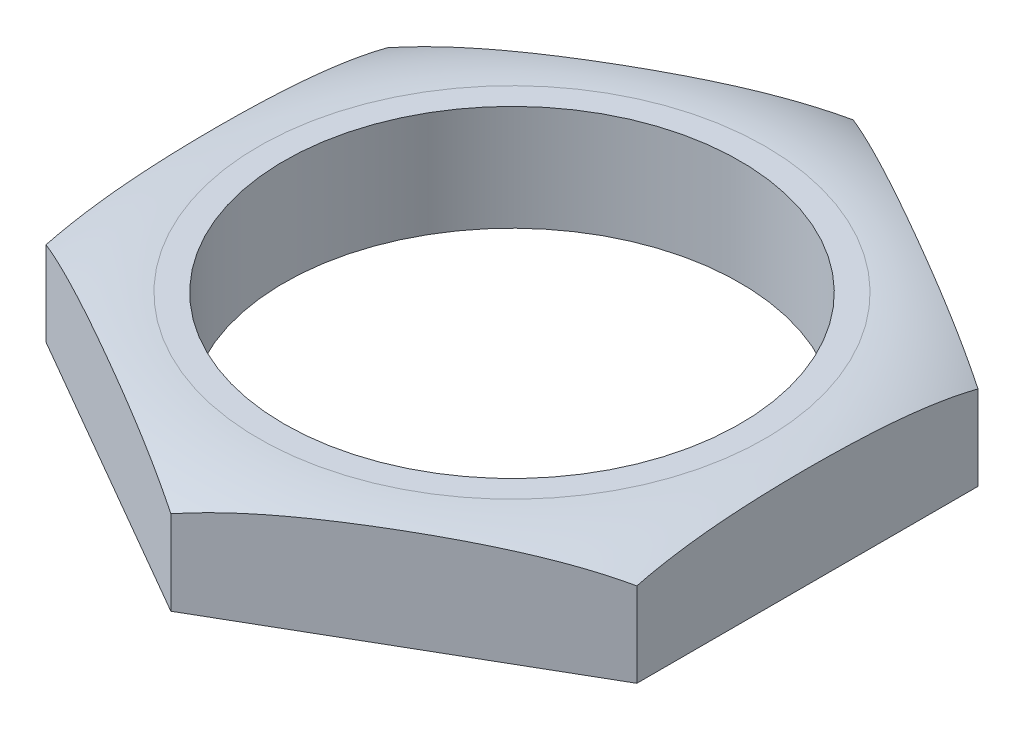
ISO-10303-21;
HEADER;
FILE_DESCRIPTION(('STEP AP214'),'2;1');
FILE_NAME('part.step','',(''),(''),'','','');
FILE_SCHEMA(('AUTOMOTIVE_DESIGN { 1 0 10303 214 1 1 1 1 }'));
ENDSEC;
DATA;
#1=APPLICATION_CONTEXT('core data for automotive mechanical design processes');
#2=APPLICATION_PROTOCOL_DEFINITION('international standard','automotive_design',2000,#1);
#3=PRODUCT_CONTEXT('',#1,'mechanical');
#4=PRODUCT('Part','Part','',(#3));
#5=PRODUCT_RELATED_PRODUCT_CATEGORY('part','',(#4));
#6=PRODUCT_DEFINITION_FORMATION('','',#4);
#7=PRODUCT_DEFINITION_CONTEXT('part definition',#1,'design');
#8=PRODUCT_DEFINITION('design','',#6,#7);
#9=PRODUCT_DEFINITION_SHAPE('','',#8);
#10=(LENGTH_UNIT() NAMED_UNIT(*) SI_UNIT(.MILLI.,.METRE.));
#11=(NAMED_UNIT(*) PLANE_ANGLE_UNIT() SI_UNIT($,.RADIAN.));
#12=(NAMED_UNIT(*) SI_UNIT($,.STERADIAN.) SOLID_ANGLE_UNIT());
#13=UNCERTAINTY_MEASURE_WITH_UNIT(LENGTH_MEASURE(1.E-05),#10,'distance_accuracy_value','');
#14=(GEOMETRIC_REPRESENTATION_CONTEXT(3) GLOBAL_UNCERTAINTY_ASSIGNED_CONTEXT((#13)) GLOBAL_UNIT_ASSIGNED_CONTEXT((#10,
#11,#12)) REPRESENTATION_CONTEXT('',''));
#15=CARTESIAN_POINT('',(0.,0.,0.));
#16=DIRECTION('',(0.,0.,1.));
#17=DIRECTION('',(1.,0.,0.));
#18=AXIS2_PLACEMENT_3D('',#15,#16,#17);
#19=CARTESIAN_POINT('',(-7.00000000000001,2.5,4.04145188432739));
#20=DIRECTION('',(0.5,0.,-0.866025403784439));
#21=DIRECTION('',(-0.866025403784439,0.,-0.5));
#22=AXIS2_PLACEMENT_3D('',#19,#20,#21);
#23=PLANE('',#22);
#24=CARTESIAN_POINT('',(-7.00020000000001,1.99994116980286,4.04133641427355));
#25=CARTESIAN_POINT('',(-6.9024311014993,2.0286993831664,4.09778331414131));
#26=CARTESIAN_POINT('',(-6.80418969926138,2.05522529599226,4.15450301416894));
#27=CARTESIAN_POINT('',(-6.60698058300385,2.10421745915421,4.26836175052687));
#28=CARTESIAN_POINT('',(-6.50801310707109,2.12668498334686,4.32550064939766));
#29=CARTESIAN_POINT('',(-6.21057702723731,2.18856517104633,4.49722545015641));
#30=CARTESIAN_POINT('',(-6.01125809296299,2.22254555707963,4.61230229051428));
#31=CARTESIAN_POINT('',(-5.61187383638535,2.27902121376591,4.84288689855947));
#32=CARTESIAN_POINT('',(-5.41181083347395,2.30153953390099,4.95839332714525));
#33=CARTESIAN_POINT('',(-5.01102203202369,2.33787021052581,5.18978884955075));
#34=CARTESIAN_POINT('',(-4.8102959726561,2.35167858888466,5.30567809396));
#35=CARTESIAN_POINT('',(-4.41139166909279,2.37247711056305,5.53598560100318));
#36=CARTESIAN_POINT('',(-4.21321681473248,2.37955940648222,5.65040190651472));
#37=CARTESIAN_POINT('',(-3.81680674878295,2.38844213687994,5.87926936480015));
#38=CARTESIAN_POINT('',(-3.61857154727333,2.39024320424813,5.9937205117546));
#39=CARTESIAN_POINT('',(-3.22195088730458,2.38889842275438,6.22270955655372));
#40=CARTESIAN_POINT('',(-3.02356543868272,2.38574852316797,6.33724744871886));
#41=CARTESIAN_POINT('',(-2.62692129753596,2.37391853623602,6.56625005038243));
#42=CARTESIAN_POINT('',(-2.42866259892704,2.3652387379873,6.68071476339347));
#43=CARTESIAN_POINT('',(-2.04346106415746,2.34159425160727,6.90311097318494));
#44=CARTESIAN_POINT('',(-1.85650172632777,2.32700568113752,7.01105199720843));
#45=CARTESIAN_POINT('',(-1.483336176554,2.28984184299611,7.22649922782261));
#46=CARTESIAN_POINT('',(-1.2971294295794,2.267273943215,7.33400574331332));
#47=CARTESIAN_POINT('',(-0.924632405346208,2.21176709168973,7.54906700052669));
#48=CARTESIAN_POINT('',(-0.738348978778219,2.17876375876016,7.65661778700128));
#49=CARTESIAN_POINT('',(-0.367459215426489,2.09976581999723,7.87075109171208));
#50=CARTESIAN_POINT('',(-0.182857484902704,2.05374271569793,7.97733095052286));
#51=CARTESIAN_POINT('',(0.000199999999992005,1.99994116980285,8.08301923870861));
#52=B_SPLINE_CURVE_WITH_KNOTS('',3,(#24,#25,#26,#27,#28,#29,#30,#31,#32,#33,#34,#35,#36,#37,#38,
#39,#40,#41,#42,#43,#44,#45,#46,#47,#48,#49,#50,#51),.UNSPECIFIED.,.F.,.F.,(4,2,2,2,2,2,2,2,2,2,
2,2,2,4),(0.,0.349439881640927,0.698769888950332,1.39630239063579,2.09242660183265,
2.78886852719074,3.47562481718198,4.16229880460008,4.84953489945155,5.53673506932823,
6.18574156363536,6.83415034176719,7.48664019182583,8.14056945107881),.UNSPECIFIED.);
#53=CARTESIAN_POINT('',(-7.00000000000001,2.00000000000001,4.04145188432739));
#54=VERTEX_POINT('',#53);
#55=CARTESIAN_POINT('',(0.,2.,8.08290376865477));
#56=VERTEX_POINT('',#55);
#57=EDGE_CURVE('E152',#54,#56,#52,.T.);
#58=ORIENTED_EDGE('',*,*,#57,.F.);
#59=DIRECTION('',(0.,-1.,0.));
#60=VECTOR('',#59,1.);
#61=CARTESIAN_POINT('',(-7.00000000000001,2.5,4.04145188432739));
#62=LINE('',#61,#60);
#63=CARTESIAN_POINT('',(-7.00000000000001,0.,4.04145188432739));
#64=VERTEX_POINT('',#63);
#65=EDGE_CURVE('E69',#54,#64,#62,.T.);
#66=ORIENTED_EDGE('',*,*,#65,.T.);
#67=DIRECTION('',(0.866025403784439,0.,0.5));
#68=VECTOR('',#67,1.);
#69=CARTESIAN_POINT('',(-7.00000000000001,0.,4.04145188432739));
#70=LINE('',#69,#68);
#71=CARTESIAN_POINT('',(0.,0.,8.08290376865477));
#72=VERTEX_POINT('',#71);
#73=EDGE_CURVE('E139',#64,#72,#70,.T.);
#74=ORIENTED_EDGE('',*,*,#73,.T.);
#75=DIRECTION('',(0.,-1.,0.));
#76=VECTOR('',#75,1.);
#77=CARTESIAN_POINT('',(0.,2.5,8.08290376865477));
#78=LINE('',#77,#76);
#79=EDGE_CURVE('E13',#56,#72,#78,.T.);
#80=ORIENTED_EDGE('',*,*,#79,.F.);
#81=EDGE_LOOP('',(#58,#66,#74,#80));
#82=FACE_BOUND('',#81,.T.);
#83=ADVANCED_FACE('F46',(#82),#23,.F.);
#84=CARTESIAN_POINT('',(0.,2.5,8.08290376865477));
#85=DIRECTION('',(-0.5,0.,-0.866025403784439));
#86=DIRECTION('',(-0.866025403784439,0.,0.5));
#87=AXIS2_PLACEMENT_3D('',#84,#85,#86);
#88=PLANE('',#87);
#89=CARTESIAN_POINT('',(-0.000199999999999705,1.99994116980285,8.08301923870861));
#90=CARTESIAN_POINT('',(0.0975688985007056,2.02869938316639,8.02657233884085));
#91=CARTESIAN_POINT('',(0.195810300738627,2.05522529599226,7.96985263881322));
#92=CARTESIAN_POINT('',(0.39301941699616,2.1042174591542,7.85599390245529));
#93=CARTESIAN_POINT('',(0.491986892928916,2.12668498334686,7.79885500358449));
#94=CARTESIAN_POINT('',(0.7894229727627,2.18856517104633,7.62713020282575));
#95=CARTESIAN_POINT('',(0.988741907037024,2.22254555707963,7.51205336246788));
#96=CARTESIAN_POINT('',(1.38812616361466,2.27902121376591,7.28146875442268));
#97=CARTESIAN_POINT('',(1.58818916652606,2.30153953390099,7.1659623258369));
#98=CARTESIAN_POINT('',(1.98897796797633,2.33787021052581,6.9345668034314));
#99=CARTESIAN_POINT('',(2.18970402734391,2.35167858888466,6.81867755902215));
#100=CARTESIAN_POINT('',(2.58860833090723,2.37247711056305,6.58837005197897));
#101=CARTESIAN_POINT('',(2.78678318526754,2.37955940648222,6.47395374646743));
#102=CARTESIAN_POINT('',(3.18319325121707,2.38844213687994,6.245086288182));
#103=CARTESIAN_POINT('',(3.38142845272669,2.39024320424813,6.13063514122755));
#104=CARTESIAN_POINT('',(3.77804911269544,2.38889842275438,5.90164609642843));
#105=CARTESIAN_POINT('',(3.9764345613173,2.38574852316797,5.78710820426329));
#106=CARTESIAN_POINT('',(4.37307870246407,2.37391853623602,5.55810560259972));
#107=CARTESIAN_POINT('',(4.57133740107298,2.3652387379873,5.44364088958868));
#108=CARTESIAN_POINT('',(4.95653893584256,2.34159425160727,5.2212446797972));
#109=CARTESIAN_POINT('',(5.14349827367225,2.32700568113752,5.11330365577372));
#110=CARTESIAN_POINT('',(5.51666382344602,2.28984184299611,4.89785642515954));
#111=CARTESIAN_POINT('',(5.70287057042062,2.267273943215,4.79034990966883));
#112=CARTESIAN_POINT('',(6.0753675946538,2.21176709168973,4.57528865245546));
#113=CARTESIAN_POINT('',(6.26165102122179,2.17876375876017,4.46773786598087));
#114=CARTESIAN_POINT('',(6.63254078457352,2.09976581999724,4.25360456127008));
#115=CARTESIAN_POINT('',(6.8171425150973,2.05374271569794,4.1470247024593));
#116=CARTESIAN_POINT('',(7.00019999999999,1.99994116980286,4.04133641427355));
#117=B_SPLINE_CURVE_WITH_KNOTS('',3,(#89,#90,#91,#92,#93,#94,#95,#96,#97,#98,#99,#100,#101,#102,
#103,#104,#105,#106,#107,#108,#109,#110,#111,#112,#113,#114,#115,#116),.UNSPECIFIED.,.F.,.F.,(4,
2,2,2,2,2,2,2,2,2,2,2,2,4),(0.,0.349439881640928,0.698769888950335,1.3963023906358,
2.09242660183266,2.78886852719076,3.475624817182,4.16229880460009,4.84953489945157,
5.53673506932825,6.18574156363537,6.8341503417672,7.48664019182583,8.1405694510788),.UNSPECIFIED.);
#118=CARTESIAN_POINT('',(7.,2.00000000000001,4.0414518843274));
#119=VERTEX_POINT('',#118);
#120=EDGE_CURVE('E153',#56,#119,#117,.T.);
#121=ORIENTED_EDGE('',*,*,#120,.F.);
#122=ORIENTED_EDGE('',*,*,#79,.T.);
#123=DIRECTION('',(0.866025403784439,0.,-0.5));
#124=VECTOR('',#123,1.);
#125=CARTESIAN_POINT('',(0.,0.,8.08290376865477));
#126=LINE('',#125,#124);
#127=CARTESIAN_POINT('',(7.,0.,4.04145188432739));
#128=VERTEX_POINT('',#127);
#129=EDGE_CURVE('E134',#72,#128,#126,.T.);
#130=ORIENTED_EDGE('',*,*,#129,.T.);
#131=DIRECTION('',(0.,-1.,0.));
#132=VECTOR('',#131,1.);
#133=CARTESIAN_POINT('',(7.,2.5,4.04145188432739));
#134=LINE('',#133,#132);
#135=EDGE_CURVE('E54',#119,#128,#134,.T.);
#136=ORIENTED_EDGE('',*,*,#135,.F.);
#137=EDGE_LOOP('',(#121,#122,#130,#136));
#138=FACE_BOUND('',#137,.T.);
#139=ADVANCED_FACE('F135',(#138),#88,.F.);
#140=CARTESIAN_POINT('',(7.,2.5,4.04145188432739));
#141=DIRECTION('',(-1.,0.,0.));
#142=DIRECTION('',(0.,0.,1.));
#143=AXIS2_PLACEMENT_3D('',#140,#141,#142);
#144=PLANE('',#143);
#145=CARTESIAN_POINT('',(6.99999999999999,2.38970607242398,0.));
#146=CARTESIAN_POINT('',(6.99999999999999,2.38970380710305,-0.153474797880013));
#147=CARTESIAN_POINT('',(6.99999999999999,2.38858612905045,-0.306948641245881));
#148=CARTESIAN_POINT('',(6.99999999999999,2.38401758755966,-0.613861027468486));
#149=CARTESIAN_POINT('',(6.99999999999999,2.38056674765726,-0.767299570665696));
#150=CARTESIAN_POINT('',(6.99999999999999,2.37106321640344,-1.0741518824378));
#151=CARTESIAN_POINT('',(6.99999999999999,2.36500964359593,-1.22756562498945));
#152=CARTESIAN_POINT('',(6.99999999999999,2.34985531271487,-1.53424094228322));
#153=CARTESIAN_POINT('',(6.99999999999999,2.34075451578797,-1.68750251506012));
#154=CARTESIAN_POINT('',(6.99999999999999,2.3080649192442,-2.14650821008781));
#155=CARTESIAN_POINT('',(6.99999999999999,2.27907832767328,-2.45191427477796));
#156=CARTESIAN_POINT('',(6.99999999999999,2.20067768750192,-3.05997729615631));
#157=CARTESIAN_POINT('',(6.99999999999999,2.15128001099699,-3.36263625794929));
#158=CARTESIAN_POINT('',(6.99999999999999,2.0186258035697,-3.99151659203636));
#159=CARTESIAN_POINT('',(6.99999999999999,1.9325495611885,-4.31717553159758));
#160=CARTESIAN_POINT('',(6.99999999999999,1.71722654974047,-4.95405760901862));
#161=CARTESIAN_POINT('',(6.99999999999999,1.58803539877385,-5.26529875972476));
#162=CARTESIAN_POINT('',(6.99999999999999,1.30834340724966,-5.80338189986762));
#163=CARTESIAN_POINT('',(6.99999999999999,1.16692743561404,-6.03483800474802));
#164=CARTESIAN_POINT('',(6.99999999999999,0.928233227054043,-6.36246423416456));
#165=CARTESIAN_POINT('',(6.99999999999999,0.844239207510924,-6.46841422047163));
#166=CARTESIAN_POINT('',(6.99999999999999,0.667320613679811,-6.67261053253427));
#167=CARTESIAN_POINT('',(6.99999999999999,0.574397823104398,-6.77085838986265));
#168=CARTESIAN_POINT('',(6.99999999999999,0.397912843244333,-6.94085531994078));
#169=CARTESIAN_POINT('',(6.99999999999999,0.315821463585398,-7.01413532931855));
#170=CARTESIAN_POINT('',(6.99999999999999,0.146079095604071,-7.153936074823));
#171=CARTESIAN_POINT('',(6.99999999999999,0.05842922210721,-7.220458159416));
#172=CARTESIAN_POINT('',(6.99999999999999,-0.122104708156981,-7.34601007506838));
#173=CARTESIAN_POINT('',(6.99999999999999,-0.214989263628966,-7.40503919052935));
#174=CARTESIAN_POINT('',(6.99999999999999,-0.405465187560716,-7.51484698382192));
#175=CARTESIAN_POINT('',(6.99999999999999,-0.503054275778988,-7.56562960752976));
#176=CARTESIAN_POINT('',(6.99999999999999,-0.702990876341273,-7.65859107812109));
#177=CARTESIAN_POINT('',(6.99999999999999,-0.805364025999912,-7.70071492477886));
#178=CARTESIAN_POINT('',(6.99999999999999,-1.01351545988163,-7.7753428365705));
#179=CARTESIAN_POINT('',(6.99999999999999,-1.11929221909229,-7.80785114526187));
#180=CARTESIAN_POINT('',(6.99999999999999,-1.33343125496827,-7.86278149447861));
#181=CARTESIAN_POINT('',(6.99999999999999,-1.44179337597888,-7.88520414061742));
#182=CARTESIAN_POINT('',(6.99999999999999,-1.66015904232018,-7.91961284032709));
#183=CARTESIAN_POINT('',(6.99999999999999,-1.77016242999534,-7.93159988983085));
#184=CARTESIAN_POINT('',(6.99999999999999,-1.97994119378055,-7.94429281633209));
#185=CARTESIAN_POINT('',(6.99999999999999,-2.0796576001692,-7.94599292316537));
#186=CARTESIAN_POINT('',(6.99999999999999,-2.2788971141417,-7.94073844585596));
#187=CARTESIAN_POINT('',(6.99999999999999,-2.37842014472676,-7.93378092721313));
#188=CARTESIAN_POINT('',(6.99999999999999,-2.57643634714082,-7.91129905778737));
#189=CARTESIAN_POINT('',(6.99999999999999,-2.67493010449194,-7.89577988197687));
#190=CARTESIAN_POINT('',(6.99999999999999,-2.87024413709382,-7.85638757995707));
#191=CARTESIAN_POINT('',(6.99999999999999,-2.96706377206045,-7.83251132855726));
#192=CARTESIAN_POINT('',(6.99999999999999,-3.24961476198406,-7.75002117367003));
#193=CARTESIAN_POINT('',(6.99999999999999,-3.43213651713589,-7.67998804117463));
#194=CARTESIAN_POINT('',(6.99999999999999,-3.78375625882706,-7.51220944744738));
#195=CARTESIAN_POINT('',(6.99999999999999,-3.95285319473115,-7.41446181999193));
#196=CARTESIAN_POINT('',(6.99999999999999,-4.28581822794355,-7.18760703783438));
#197=CARTESIAN_POINT('',(6.99999999999999,-4.44852815183203,-7.05680627610971));
#198=CARTESIAN_POINT('',(6.99999999999999,-4.75333265351634,-6.77301770900496));
#199=CARTESIAN_POINT('',(6.99999999999999,-4.89541094290621,-6.62001256203388));
#200=CARTESIAN_POINT('',(6.99999999999999,-5.12351287077039,-6.33957063845203));
#201=CARTESIAN_POINT('',(6.99999999999999,-5.2144322703192,-6.21604876030427));
#202=CARTESIAN_POINT('',(6.99999999999999,-5.38499478121861,-5.96142369386902));
#203=CARTESIAN_POINT('',(6.99999999999999,-5.46463352341515,-5.83031759564708));
#204=CARTESIAN_POINT('',(6.99999999999999,-5.68724788208596,-5.42796406276954));
#205=CARTESIAN_POINT('',(6.99999999999999,-5.81396431770249,-5.14762708255227));
#206=CARTESIAN_POINT('',(6.99999999999999,-6.01041854508655,-4.62420313737151));
#207=CARTESIAN_POINT('',(6.99999999999999,-6.08626885905089,-4.38329133387102));
#208=CARTESIAN_POINT('',(6.99999999999999,-6.21654925850452,-3.89560716687764));
#209=CARTESIAN_POINT('',(6.99999999999999,-6.27096223892484,-3.64883028937009));
#210=CARTESIAN_POINT('',(6.99999999999999,-6.36269037059578,-3.1508441112275));
#211=CARTESIAN_POINT('',(6.99999999999999,-6.39991016719901,-2.89961792933025));
#212=CARTESIAN_POINT('',(6.99999999999999,-6.46084811563187,-2.39566329281924));
#213=CARTESIAN_POINT('',(6.99999999999999,-6.48456981256615,-2.14293525028586));
#214=CARTESIAN_POINT('',(6.99999999999999,-6.51858850823015,-1.68215858925161));
#215=CARTESIAN_POINT('',(6.99999999999999,-6.5305299208123,-1.4742236086835));
#216=CARTESIAN_POINT('',(6.99999999999999,-6.54906143468367,-1.05810455238561));
#217=CARTESIAN_POINT('',(6.99999999999999,-6.55565109172148,-0.849920457412993));
#218=CARTESIAN_POINT('',(6.99999999999999,-6.56440651058935,-0.433298560899161));
#219=CARTESIAN_POINT('',(6.99999999999999,-6.56656873831265,-0.224860689466228));
#220=CARTESIAN_POINT('',(6.99999999999999,-6.56678723713752,0.192008531875751));
#221=CARTESIAN_POINT('',(6.99999999999999,-6.56484368342921,0.400439881683582));
#222=CARTESIAN_POINT('',(6.99999999999999,-6.55657163845878,0.816358710062174));
#223=CARTESIAN_POINT('',(6.99999999999999,-6.55026128189937,1.02384653308402));
#224=CARTESIAN_POINT('',(6.99999999999999,-6.53239018971206,1.43862365537169));
#225=CARTESIAN_POINT('',(6.99999999999999,-6.52082901392069,1.64591293653412));
#226=CARTESIAN_POINT('',(6.99999999999999,-6.49107253506154,2.05978432243926));
#227=CARTESIAN_POINT('',(6.99999999999999,-6.47288508693345,2.26636697336596));
#228=CARTESIAN_POINT('',(6.99999999999999,-6.42806910735174,2.67859610998877));
#229=CARTESIAN_POINT('',(7.,-6.40144271589586,2.88424281963031));
#230=CARTESIAN_POINT('',(7.,-6.3445190691219,3.24975962090773));
#231=CARTESIAN_POINT('',(7.,-6.31625001048584,3.40994262168731));
#232=CARTESIAN_POINT('',(7.,-6.25212076879051,3.72881934231341));
#233=CARTESIAN_POINT('',(7.,-6.21625984084868,3.88751291442666));
#234=CARTESIAN_POINT('',(7.,-6.13582370636988,4.20272110922243));
#235=CARTESIAN_POINT('',(7.,-6.0912474208148,4.35923545953024));
#236=CARTESIAN_POINT('',(7.,-5.99227926457707,4.66915357255124));
#237=CARTESIAN_POINT('',(7.,-5.93788770555855,4.82255743385972));
#238=CARTESIAN_POINT('',(7.,-5.81744361415367,5.12714453125906));
#239=CARTESIAN_POINT('',(7.,-5.75124405976618,5.27827013542966));
#240=CARTESIAN_POINT('',(7.,-5.60676552948873,5.57462580985689));
#241=CARTESIAN_POINT('',(7.,-5.52849004964834,5.71985757109346));
#242=CARTESIAN_POINT('',(7.,-5.35922285290208,6.00251022801988));
#243=CARTESIAN_POINT('',(7.,-5.26824715260247,6.13994065979281));
#244=CARTESIAN_POINT('',(7.,-5.07310020717452,6.40508109391197));
#245=CARTESIAN_POINT('',(7.,-4.96893559699309,6.53279593252323));
#246=CARTESIAN_POINT('',(7.,-4.78253027773868,6.73763399143548));
#247=CARTESIAN_POINT('',(7.,-4.70379806632288,6.81796702956086));
#248=CARTESIAN_POINT('',(7.,-4.540318291138,6.97224596864263));
#249=CARTESIAN_POINT('',(7.,-4.45557230662786,7.04619353524344));
#250=CARTESIAN_POINT('',(7.,-4.28031009926545,7.18691142957461));
#251=CARTESIAN_POINT('',(7.,-4.18979405130168,7.25368197467322));
#252=CARTESIAN_POINT('',(7.,-4.00342258484872,7.37922307594957));
#253=CARTESIAN_POINT('',(7.,-3.90756968410959,7.43799736017995));
#254=CARTESIAN_POINT('',(7.,-3.71032408786865,7.54720086865784));
#255=CARTESIAN_POINT('',(7.,-3.60889705056362,7.59756822861717));
#256=CARTESIAN_POINT('',(7.,-3.40186630654638,7.68871026796446));
#257=CARTESIAN_POINT('',(7.,-3.29626454183861,7.72948934770584));
#258=CARTESIAN_POINT('',(7.,-3.08167410328328,7.80086342201253));
#259=CARTESIAN_POINT('',(7.,-2.97268564482536,7.83145906278877));
#260=CARTESIAN_POINT('',(7.,-2.75226517810287,7.88197889287165));
#261=CARTESIAN_POINT('',(7.,-2.64083343686204,7.90190424233139));
#262=CARTESIAN_POINT('',(7.,-2.42828713428676,7.92925131876027));
#263=CARTESIAN_POINT('',(7.,-2.32731143330575,7.93776217651678));
#264=CARTESIAN_POINT('',(7.,-2.12496579268856,7.94585842612113));
#265=CARTESIAN_POINT('',(7.,-2.02359573018757,7.94544076870151));
#266=CARTESIAN_POINT('',(7.,-1.82135186970049,7.93567618224392));
#267=CARTESIAN_POINT('',(7.,-1.72047777862864,7.92633538770141));
#268=CARTESIAN_POINT('',(7.,-1.51992128828028,7.89887009464376));
#269=CARTESIAN_POINT('',(7.,-1.42023934448726,7.88074234225376));
#270=CARTESIAN_POINT('',(7.,-1.13225032443934,7.81533140302399));
#271=CARTESIAN_POINT('',(7.,-0.946431189926209,7.75655332582932));
#272=CARTESIAN_POINT('',(7.,-0.586702067967606,7.61017419221811));
#273=CARTESIAN_POINT('',(7.,-0.412793081505804,7.52257071676514));
#274=CARTESIAN_POINT('',(7.,-0.0713998261189954,7.31688328456176));
#275=CARTESIAN_POINT('',(7.,0.0952567509406784,7.19743107380679));
#276=CARTESIAN_POINT('',(7.,0.40920323530402,6.93534919153726));
#277=CARTESIAN_POINT('',(7.,0.556483471018514,6.79270802420508));
#278=CARTESIAN_POINT('',(7.,0.790990143441878,6.53294931832184));
#279=CARTESIAN_POINT('',(7.,0.883287798460253,6.42033107068375));
#280=CARTESIAN_POINT('',(7.,1.05759312254795,6.18737229192974));
#281=CARTESIAN_POINT('',(7.,1.13959726772831,6.06702913745626));
#282=CARTESIAN_POINT('',(7.,1.37063740287318,5.69633426627025));
#283=CARTESIAN_POINT('',(7.,1.50457660135089,5.43645926557818));
#284=CARTESIAN_POINT('',(7.,1.71047300790161,4.960730273259));
#285=CARTESIAN_POINT('',(7.,1.78958605638935,4.74782869719772));
#286=CARTESIAN_POINT('',(7.,1.9287042211905,4.31575039233941));
#287=CARTESIAN_POINT('',(7.,1.98869650340562,4.09656955592443));
#288=CARTESIAN_POINT('',(7.,2.09258189243331,3.65407418034792));
#289=CARTESIAN_POINT('',(7.,2.1364430608383,3.43075235037118));
#290=CARTESIAN_POINT('',(7.,2.21095405128979,2.98201160960899));
#291=CARTESIAN_POINT('',(6.99999999999999,2.24160617250766,2.75659307076118));
#292=CARTESIAN_POINT('',(6.99999999999999,2.29072189196327,2.32065837446527));
#293=CARTESIAN_POINT('',(6.99999999999999,2.30989573163815,2.11021911723506));
#294=CARTESIAN_POINT('',(6.99999999999999,2.34122733977781,1.6888374593472));
#295=CARTESIAN_POINT('',(6.99999999999999,2.35338515004378,1.47789506169477));
#296=CARTESIAN_POINT('',(6.99999999999999,2.37219095307572,1.05584328395048));
#297=CARTESIAN_POINT('',(6.99999999999999,2.37884068422983,0.844733977607092));
#298=CARTESIAN_POINT('',(6.99999999999999,2.38759989763807,0.422415847474331));
#299=CARTESIAN_POINT('',(6.99999999999999,2.38970918988489,0.211207019890145));
#300=CARTESIAN_POINT('',(6.99999999999999,2.38970607242398,0.));
#301=B_SPLINE_CURVE_WITH_KNOTS('',3,(#145,#146,#147,#148,#149,#150,#151,#152,#153,#154,#155,
#156,#157,#158,#159,#160,#161,#162,#163,#164,#165,#166,#167,#168,#169,#170,#171,#172,#173,#174,
#175,#176,#177,#178,#179,#180,#181,#182,#183,#184,#185,#186,#187,#188,#189,#190,#191,#192,#193,
#194,#195,#196,#197,#198,#199,#200,#201,#202,#203,#204,#205,#206,#207,#208,#209,#210,#211,#212,
#213,#214,#215,#216,#217,#218,#219,#220,#221,#222,#223,#224,#225,#226,#227,#228,#229,#230,#231,
#232,#233,#234,#235,#236,#237,#238,#239,#240,#241,#242,#243,#244,#245,#246,#247,#248,#249,#250,
#251,#252,#253,#254,#255,#256,#257,#258,#259,#260,#261,#262,#263,#264,#265,#266,#267,#268,#269,
#270,#271,#272,#273,#274,#275,#276,#277,#278,#279,#280,#281,#282,#283,#284,#285,#286,#287,#288,
#289,#290,#291,#292,#293,#294,#295,#296,#297,#298,#299,#300),.UNSPECIFIED.,.T.,.F.,(4,2,2,2,2,2,
2,2,2,2,2,2,2,2,2,2,2,2,2,2,2,2,2,2,2,2,2,2,2,2,2,2,2,2,2,2,2,2,2,2,2,2,2,2,2,2,2,2,2,2,2,2,2,2,
2,2,2,2,2,2,2,2,2,2,2,2,2,2,2,2,2,2,2,2,2,2,2,4),(0.,0.460418193545401,0.920831742687712,
1.38140134102967,1.8419768120439,2.76180550663538,3.68089781808519,4.68914910012407,
5.6961047364611,6.50646555562077,6.9116535306853,7.3167607284291,7.64656421856631,
7.97630177040681,8.30607078940291,8.63568154879129,8.96732535251315,9.29882257508887,
9.63029988960375,9.96174556573918,10.2605685250411,10.5594927979104,10.8582365878805,
11.1570922148803,11.7407885194304,12.3245304595027,12.9483932507842,13.5727459266056,
14.0322570418937,14.4919456483542,15.4111182554443,16.1678090237024,16.9251023463938,
17.6865466850622,18.44779094762,19.0725468688563,19.6973546460388,20.322660969395,
20.9479406120147,21.5706390204822,22.1933896378873,22.8154044212551,23.4372615964284,
23.9250843604531,24.4129550098146,24.9008860990354,25.3888016977177,25.8832807888448,
26.3776169931552,26.8713353153236,27.3648062421044,27.7019478642097,28.0390012758854,
28.3760444764492,28.7129299967525,29.0521946133448,29.3913032258536,29.7303903154274,
30.0694405294527,30.3730562541394,30.6767756713573,30.9802864371198,31.2839096811045,
31.8657481442528,32.4476354479255,33.0603316701021,33.6733325650593,34.1095851718075,
34.5459867206775,35.4193494311912,36.0998407941974,36.7807879543085,37.4630761721432,
38.145245582636,38.779035476024,39.4128215932812,40.0464076069281,40.6800201342301),.UNSPECIFIED.);
#302=CARTESIAN_POINT('',(7.00000000000001,2.00000000000002,-4.04145188432737));
#303=VERTEX_POINT('',#302);
#304=EDGE_CURVE('E101',#119,#303,#301,.T.);
#305=ORIENTED_EDGE('',*,*,#304,.F.);
#306=ORIENTED_EDGE('',*,*,#135,.T.);
#307=DIRECTION('',(0.,0.,-1.));
#308=VECTOR('',#307,1.);
#309=CARTESIAN_POINT('',(7.,0.,4.04145188432739));
#310=LINE('',#309,#308);
#311=CARTESIAN_POINT('',(6.99999999999999,0.,-4.04145188432738));
#312=VERTEX_POINT('',#311);
#313=EDGE_CURVE('E130',#128,#312,#310,.T.);
#314=ORIENTED_EDGE('',*,*,#313,.T.);
#315=DIRECTION('',(0.,-1.,0.));
#316=VECTOR('',#315,1.);
#317=CARTESIAN_POINT('',(6.99999999999999,2.5,-4.04145188432738));
#318=LINE('',#317,#316);
#319=EDGE_CURVE('E119',#303,#312,#318,.T.);
#320=ORIENTED_EDGE('',*,*,#319,.F.);
#321=EDGE_LOOP('',(#305,#306,#314,#320));
#322=FACE_BOUND('',#321,.T.);
#323=ADVANCED_FACE('F128',(#322),#144,.F.);
#324=CARTESIAN_POINT('',(6.99999999999999,2.5,-4.04145188432738));
#325=DIRECTION('',(-0.5,0.,0.866025403784439));
#326=DIRECTION('',(0.866025403784439,0.,0.5));
#327=AXIS2_PLACEMENT_3D('',#324,#325,#326);
#328=PLANE('',#327);
#329=CARTESIAN_POINT('',(7.00019999999999,1.99994116980288,-4.04133641427354));
#330=CARTESIAN_POINT('',(6.90243110149929,2.02869938316642,-4.0977833141413));
#331=CARTESIAN_POINT('',(6.80418969926136,2.05522529599228,-4.15450301416893));
#332=CARTESIAN_POINT('',(6.60698058300383,2.10421745915423,-4.26836175052686));
#333=CARTESIAN_POINT('',(6.50801310707107,2.12668498334688,-4.32550064939766));
#334=CARTESIAN_POINT('',(6.21057702723729,2.18856517104635,-4.4972254501564));
#335=CARTESIAN_POINT('',(6.01125809296296,2.22254555707965,-4.61230229051427));
#336=CARTESIAN_POINT('',(5.61187383638532,2.27902121376593,-4.84288689855947));
#337=CARTESIAN_POINT('',(5.41181083347391,2.30153953390101,-4.95839332714526));
#338=CARTESIAN_POINT('',(5.01102203202365,2.33787021052584,-5.18978884955076));
#339=CARTESIAN_POINT('',(4.81029597265606,2.35167858888469,-5.30567809396001));
#340=CARTESIAN_POINT('',(4.41139166909274,2.37247711056308,-5.53598560100319));
#341=CARTESIAN_POINT('',(4.21321681473243,2.37955940648224,-5.65040190651473));
#342=CARTESIAN_POINT('',(3.8168067487829,2.38844213687996,-5.87926936480017));
#343=CARTESIAN_POINT('',(3.61857154727327,2.39024320424815,-5.99372051175461));
#344=CARTESIAN_POINT('',(3.22195088730451,2.3888984227544,-6.22270955655374));
#345=CARTESIAN_POINT('',(3.02356543868265,2.38574852316799,-6.33724744871888));
#346=CARTESIAN_POINT('',(2.62692129753588,2.37391853623604,-6.56625005038245));
#347=CARTESIAN_POINT('',(2.42866259892697,2.36523873798732,-6.6807147633935));
#348=CARTESIAN_POINT('',(2.04346106415739,2.34159425160729,-6.90311097318497));
#349=CARTESIAN_POINT('',(1.85650172632771,2.32700568113754,-7.01105199720845));
#350=CARTESIAN_POINT('',(1.48333617655395,2.28984184299613,-7.22649922782262));
#351=CARTESIAN_POINT('',(1.29712942957935,2.26727394321502,-7.33400574331333));
#352=CARTESIAN_POINT('',(0.924632405346171,2.21176709168975,-7.54906700052669));
#353=CARTESIAN_POINT('',(0.738348978778189,2.17876375876019,-7.65661778700128));
#354=CARTESIAN_POINT('',(0.36745921542647,2.09976581999726,-7.87075109171207));
#355=CARTESIAN_POINT('',(0.18285748490269,2.05374271569796,-7.97733095052285));
#356=CARTESIAN_POINT('',(-0.000200000000000166,1.99994116980288,-8.08301923870859));
#357=B_SPLINE_CURVE_WITH_KNOTS('',3,(#329,#330,#331,#332,#333,#334,#335,#336,#337,#338,#339,
#340,#341,#342,#343,#344,#345,#346,#347,#348,#349,#350,#351,#352,#353,#354,#355,#356),
.UNSPECIFIED.,.F.,.F.,(4,2,2,2,2,2,2,2,2,2,2,2,2,4),(0.,0.34943988164093,0.69876988895034,
1.39630239063581,2.09242660183268,2.78886852719078,3.47562481718203,4.16229880460013,
4.84953489945162,5.5367350693283,6.18574156363541,6.83415034176722,7.48664019182584,
8.1405694510788),.UNSPECIFIED.);
#358=CARTESIAN_POINT('',(0.,2.00000000000003,-8.08290376865476));
#359=VERTEX_POINT('',#358);
#360=EDGE_CURVE('E98',#303,#359,#357,.T.);
#361=ORIENTED_EDGE('',*,*,#360,.F.);
#362=ORIENTED_EDGE('',*,*,#319,.T.);
#363=DIRECTION('',(-0.866025403784439,0.,-0.5));
#364=VECTOR('',#363,1.);
#365=CARTESIAN_POINT('',(6.99999999999999,0.,-4.04145188432738));
#366=LINE('',#365,#364);
#367=CARTESIAN_POINT('',(0.,0.,-8.08290376865476));
#368=VERTEX_POINT('',#367);
#369=EDGE_CURVE('E117',#312,#368,#366,.T.);
#370=ORIENTED_EDGE('',*,*,#369,.T.);
#371=DIRECTION('',(0.,-1.,0.));
#372=VECTOR('',#371,1.);
#373=CARTESIAN_POINT('',(0.,2.5,-8.08290376865476));
#374=LINE('',#373,#372);
#375=EDGE_CURVE('E110',#359,#368,#374,.T.);
#376=ORIENTED_EDGE('',*,*,#375,.F.);
#377=EDGE_LOOP('',(#361,#362,#370,#376));
#378=FACE_BOUND('',#377,.T.);
#379=ADVANCED_FACE('F115',(#378),#328,.F.);
#380=CARTESIAN_POINT('',(0.,2.5,-8.08290376865476));
#381=DIRECTION('',(0.5,0.,0.866025403784438));
#382=DIRECTION('',(0.866025403784438,0.,-0.5));
#383=AXIS2_PLACEMENT_3D('',#380,#381,#382);
#384=PLANE('',#383);
#385=CARTESIAN_POINT('',(0.000199999999992063,1.99994116980288,-8.08301923870859));
#386=CARTESIAN_POINT('',(-0.0975688985007135,2.02869938316642,-8.02657233884084));
#387=CARTESIAN_POINT('',(-0.195810300738636,2.05522529599229,-7.96985263881321));
#388=CARTESIAN_POINT('',(-0.39301941699617,2.10421745915423,-7.85599390245527));
#389=CARTESIAN_POINT('',(-0.491986892928926,2.12668498334689,-7.79885500358448));
#390=CARTESIAN_POINT('',(-0.789422972762712,2.18856517104636,-7.62713020282573));
#391=CARTESIAN_POINT('',(-0.988741907037038,2.22254555707966,-7.51205336246786));
#392=CARTESIAN_POINT('',(-1.38812616361468,2.27902121376594,-7.28146875442266));
#393=CARTESIAN_POINT('',(-1.58818916652608,2.30153953390101,-7.16596232583688));
#394=CARTESIAN_POINT('',(-1.98897796797635,2.33787021052584,-6.93456680343138));
#395=CARTESIAN_POINT('',(-2.18970402734393,2.35167858888469,-6.81867755902213));
#396=CARTESIAN_POINT('',(-2.58860833090725,2.37247711056308,-6.58837005197895));
#397=CARTESIAN_POINT('',(-2.78678318526757,2.37955940648224,-6.47395374646741));
#398=CARTESIAN_POINT('',(-3.1831932512171,2.38844213687996,-6.24508628818197));
#399=CARTESIAN_POINT('',(-3.38142845272672,2.39024320424815,-6.13063514122752));
#400=CARTESIAN_POINT('',(-3.77804911269548,2.3888984227544,-5.9016460964284));
#401=CARTESIAN_POINT('',(-3.97643456131734,2.38574852316799,-5.78710820426326));
#402=CARTESIAN_POINT('',(-4.37307870246411,2.37391853623604,-5.55810560259969));
#403=CARTESIAN_POINT('',(-4.57133740107302,2.36523873798732,-5.44364088958864));
#404=CARTESIAN_POINT('',(-4.9565389358426,2.34159425160729,-5.22124467979717));
#405=CARTESIAN_POINT('',(-5.14349827367228,2.32700568113753,-5.11330365577369));
#406=CARTESIAN_POINT('',(-5.51666382344605,2.28984184299613,-4.89785642515951));
#407=CARTESIAN_POINT('',(-5.70287057042064,2.26727394321502,-4.7903499096688));
#408=CARTESIAN_POINT('',(-6.07536759465383,2.21176709168974,-4.57528865245544));
#409=CARTESIAN_POINT('',(-6.26165102122181,2.17876375876018,-4.46773786598085));
#410=CARTESIAN_POINT('',(-6.63254078457353,2.09976581999725,-4.25360456127005));
#411=CARTESIAN_POINT('',(-6.81714251509731,2.05374271569796,-4.14702470245928));
#412=CARTESIAN_POINT('',(-7.0002,1.99994116980287,-4.04133641427353));
#413=B_SPLINE_CURVE_WITH_KNOTS('',3,(#385,#386,#387,#388,#389,#390,#391,#392,#393,#394,#395,
#396,#397,#398,#399,#400,#401,#402,#403,#404,#405,#406,#407,#408,#409,#410,#411,#412),
.UNSPECIFIED.,.F.,.F.,(4,2,2,2,2,2,2,2,2,2,2,2,2,4),(0.,0.34943988164093,0.69876988895034,
1.39630239063581,2.09242660183268,2.78886852719077,3.47562481718202,4.16229880460012,
4.8495348994516,5.53673506932829,6.1857415636354,6.83415034176722,7.48664019182584,
8.1405694510788),.UNSPECIFIED.);
#414=CARTESIAN_POINT('',(-7.00000000000001,2.00000000000002,-4.04145188432737));
#415=VERTEX_POINT('',#414);
#416=EDGE_CURVE('E61',#359,#415,#413,.T.);
#417=ORIENTED_EDGE('',*,*,#416,.F.);
#418=ORIENTED_EDGE('',*,*,#375,.T.);
#419=DIRECTION('',(-0.866025403784438,0.,0.5));
#420=VECTOR('',#419,1.);
#421=CARTESIAN_POINT('',(0.,0.,-8.08290376865476));
#422=LINE('',#421,#420);
#423=CARTESIAN_POINT('',(-7.00000000000001,0.,-4.04145188432737));
#424=VERTEX_POINT('',#423);
#425=EDGE_CURVE('E143',#368,#424,#422,.T.);
#426=ORIENTED_EDGE('',*,*,#425,.T.);
#427=DIRECTION('',(0.,-1.,0.));
#428=VECTOR('',#427,1.);
#429=CARTESIAN_POINT('',(-7.00000000000001,2.5,-4.04145188432737));
#430=LINE('',#429,#428);
#431=EDGE_CURVE('E112',#415,#424,#430,.T.);
#432=ORIENTED_EDGE('',*,*,#431,.F.);
#433=EDGE_LOOP('',(#417,#418,#426,#432));
#434=FACE_BOUND('',#433,.T.);
#435=ADVANCED_FACE('F108',(#434),#384,.F.);
#436=CARTESIAN_POINT('',(-7.00000000000001,2.5,-4.04145188432737));
#437=DIRECTION('',(1.,0.,0.));
#438=DIRECTION('',(0.,0.,-1.));
#439=AXIS2_PLACEMENT_3D('',#436,#437,#438);
#440=PLANE('',#439);
#441=CARTESIAN_POINT('',(-7.00000000000001,2.38970607242397,0.));
#442=CARTESIAN_POINT('',(-7.00000000000001,2.38970380710304,0.153474797880027));
#443=CARTESIAN_POINT('',(-7.00000000000001,2.38858612905044,0.306948641245896));
#444=CARTESIAN_POINT('',(-7.00000000000001,2.38401758755965,0.613861027468504));
#445=CARTESIAN_POINT('',(-7.00000000000001,2.38056674765726,0.767299570665714));
#446=CARTESIAN_POINT('',(-7.00000000000001,2.37106321640343,1.07415188243781));
#447=CARTESIAN_POINT('',(-7.00000000000001,2.36500964359593,1.22756562498947));
#448=CARTESIAN_POINT('',(-7.00000000000001,2.34985531271486,1.53424094228324));
#449=CARTESIAN_POINT('',(-7.00000000000001,2.34075451578796,1.68750251506014));
#450=CARTESIAN_POINT('',(-7.00000000000001,2.30806491924419,2.14650821008783));
#451=CARTESIAN_POINT('',(-7.00000000000001,2.27907832767327,2.45191427477798));
#452=CARTESIAN_POINT('',(-7.00000000000001,2.2006776875019,3.05997729615634));
#453=CARTESIAN_POINT('',(-7.00000000000001,2.15128001099697,3.36263625794932));
#454=CARTESIAN_POINT('',(-7.00000000000001,2.01862580356968,3.99151659203639));
#455=CARTESIAN_POINT('',(-7.00000000000001,1.93254956118847,4.31717553159761));
#456=CARTESIAN_POINT('',(-7.00000000000001,1.71722654974045,4.95405760901863));
#457=CARTESIAN_POINT('',(-7.00000000000001,1.58803539877382,5.26529875972477));
#458=CARTESIAN_POINT('',(-7.00000000000001,1.30834340724963,5.80338189986762));
#459=CARTESIAN_POINT('',(-7.00000000000001,1.16692743561401,6.03483800474803));
#460=CARTESIAN_POINT('',(-7.00000000000001,0.928233227054007,6.36246423416457));
#461=CARTESIAN_POINT('',(-7.00000000000001,0.844239207510889,6.46841422047163));
#462=CARTESIAN_POINT('',(-7.00000000000001,0.667320613679775,6.67261053253427));
#463=CARTESIAN_POINT('',(-7.00000000000001,0.574397823104361,6.77085838986265));
#464=CARTESIAN_POINT('',(-7.00000000000001,0.397912843244295,6.94085531994078));
#465=CARTESIAN_POINT('',(-7.00000000000001,0.315821463585361,7.01413532931855));
#466=CARTESIAN_POINT('',(-7.00000000000001,0.146079095604032,7.15393607482299));
#467=CARTESIAN_POINT('',(-7.00000000000001,0.0584292221071701,7.22045815941599));
#468=CARTESIAN_POINT('',(-7.00000000000001,-0.122104708157021,7.34601007506838));
#469=CARTESIAN_POINT('',(-7.00000000000001,-0.214989263629006,7.40503919052934));
#470=CARTESIAN_POINT('',(-7.00000000000001,-0.405465187560755,7.51484698382191));
#471=CARTESIAN_POINT('',(-7.00000000000001,-0.503054275779026,7.56562960752975));
#472=CARTESIAN_POINT('',(-7.00000000000001,-0.702990876341312,7.65859107812108));
#473=CARTESIAN_POINT('',(-7.00000000000001,-0.80536402599995,7.70071492477884));
#474=CARTESIAN_POINT('',(-7.00000000000001,-1.01351545988167,7.77534283657049));
#475=CARTESIAN_POINT('',(-7.00000000000001,-1.11929221909233,7.80785114526186));
#476=CARTESIAN_POINT('',(-7.00000000000001,-1.3334312549683,7.86278149447859));
#477=CARTESIAN_POINT('',(-7.00000000000001,-1.44179337597892,7.8852041406174));
#478=CARTESIAN_POINT('',(-7.00000000000001,-1.66015904232022,7.91961284032707));
#479=CARTESIAN_POINT('',(-7.00000000000001,-1.77016242999537,7.93159988983083));
#480=CARTESIAN_POINT('',(-7.00000000000001,-1.97994119378058,7.94429281633207));
#481=CARTESIAN_POINT('',(-7.00000000000001,-2.07965760016923,7.94599292316535));
#482=CARTESIAN_POINT('',(-7.00000000000001,-2.27889711414174,7.94073844585594));
#483=CARTESIAN_POINT('',(-7.00000000000001,-2.37842014472679,7.93378092721311));
#484=CARTESIAN_POINT('',(-7.00000000000001,-2.57643634714086,7.91129905778735));
#485=CARTESIAN_POINT('',(-7.00000000000001,-2.67493010449197,7.89577988197684));
#486=CARTESIAN_POINT('',(-7.00000000000001,-2.87024413709386,7.85638757995704));
#487=CARTESIAN_POINT('',(-7.00000000000001,-2.96706377206048,7.83251132855724));
#488=CARTESIAN_POINT('',(-7.00000000000001,-3.2496147619841,7.75002117367));
#489=CARTESIAN_POINT('',(-7.00000000000001,-3.43213651713592,7.6799880411746));
#490=CARTESIAN_POINT('',(-7.00000000000001,-3.78375625882709,7.51220944744735));
#491=CARTESIAN_POINT('',(-7.00000000000001,-3.95285319473118,7.4144618199919));
#492=CARTESIAN_POINT('',(-7.00000000000001,-4.28581822794358,7.18760703783435));
#493=CARTESIAN_POINT('',(-7.00000000000001,-4.44852815183206,7.05680627610968));
#494=CARTESIAN_POINT('',(-7.00000000000001,-4.75333265351637,6.77301770900493));
#495=CARTESIAN_POINT('',(-7.00000000000001,-4.89541094290623,6.62001256203384));
#496=CARTESIAN_POINT('',(-7.00000000000001,-5.12351287077041,6.33957063845199));
#497=CARTESIAN_POINT('',(-7.00000000000001,-5.21443227031922,6.21604876030423));
#498=CARTESIAN_POINT('',(-7.00000000000001,-5.38499478121863,5.96142369386898));
#499=CARTESIAN_POINT('',(-7.00000000000001,-5.46463352341517,5.83031759564704));
#500=CARTESIAN_POINT('',(-7.00000000000001,-5.68724788208598,5.42796406276949));
#501=CARTESIAN_POINT('',(-7.00000000000001,-5.81396431770251,5.14762708255223));
#502=CARTESIAN_POINT('',(-7.00000000000001,-6.01041854508656,4.62420313737146));
#503=CARTESIAN_POINT('',(-7.00000000000001,-6.0862688590509,4.38329133387097));
#504=CARTESIAN_POINT('',(-7.00000000000001,-6.21654925850453,3.89560716687758));
#505=CARTESIAN_POINT('',(-7.00000000000001,-6.27096223892486,3.64883028937003));
#506=CARTESIAN_POINT('',(-7.00000000000001,-6.36269037059579,3.15084411122744));
#507=CARTESIAN_POINT('',(-7.00000000000001,-6.39991016719902,2.89961792933019));
#508=CARTESIAN_POINT('',(-7.00000000000001,-6.46084811563188,2.39566329281918));
#509=CARTESIAN_POINT('',(-7.00000000000001,-6.48456981256616,2.1429352502858));
#510=CARTESIAN_POINT('',(-7.00000000000001,-6.51858850823016,1.68215858925155));
#511=CARTESIAN_POINT('',(-7.00000000000001,-6.5305299208123,1.47422360868344));
#512=CARTESIAN_POINT('',(-7.00000000000001,-6.54906143468367,1.05810455238556));
#513=CARTESIAN_POINT('',(-7.00000000000001,-6.55565109172148,0.849920457412947));
#514=CARTESIAN_POINT('',(-7.00000000000001,-6.56440651058935,0.433298560899124));
#515=CARTESIAN_POINT('',(-7.00000000000001,-6.56656873831265,0.224860689466196));
#516=CARTESIAN_POINT('',(-7.00000000000001,-6.56678723713752,-0.192008531875773));
#517=CARTESIAN_POINT('',(-7.00000000000001,-6.5648436834292,-0.400439881683599));
#518=CARTESIAN_POINT('',(-7.00000000000001,-6.55657163845878,-0.81635871006218));
#519=CARTESIAN_POINT('',(-7.00000000000001,-6.55026128189936,-1.02384653308402));
#520=CARTESIAN_POINT('',(-7.00000000000001,-6.53239018971205,-1.43862365537168));
#521=CARTESIAN_POINT('',(-7.00000000000001,-6.52082901392069,-1.6459129365341));
#522=CARTESIAN_POINT('',(-7.00000000000001,-6.49107253506153,-2.05978432243923));
#523=CARTESIAN_POINT('',(-7.00000000000001,-6.47288508693344,-2.26636697336593));
#524=CARTESIAN_POINT('',(-7.00000000000001,-6.42806910735174,-2.67859610998873));
#525=CARTESIAN_POINT('',(-7.00000000000001,-6.40144271589585,-2.88424281963027));
#526=CARTESIAN_POINT('',(-7.00000000000001,-6.3445190691219,-3.24975962090769));
#527=CARTESIAN_POINT('',(-7.00000000000001,-6.31625001048583,-3.40994262168727));
#528=CARTESIAN_POINT('',(-7.00000000000001,-6.2521207687905,-3.72881934231338));
#529=CARTESIAN_POINT('',(-7.00000000000001,-6.21625984084868,-3.88751291442664));
#530=CARTESIAN_POINT('',(-7.00000000000001,-6.13582370636987,-4.20272110922242));
#531=CARTESIAN_POINT('',(-7.00000000000001,-6.09124742081479,-4.35923545953023));
#532=CARTESIAN_POINT('',(-7.00000000000001,-5.99227926457706,-4.66915357255123));
#533=CARTESIAN_POINT('',(-7.00000000000001,-5.93788770555854,-4.82255743385972));
#534=CARTESIAN_POINT('',(-7.00000000000001,-5.81744361415365,-5.12714453125906));
#535=CARTESIAN_POINT('',(-7.00000000000001,-5.75124405976616,-5.27827013542967));
#536=CARTESIAN_POINT('',(-7.00000000000001,-5.60676552948871,-5.57462580985691));
#537=CARTESIAN_POINT('',(-7.00000000000001,-5.52849004964831,-5.71985757109348));
#538=CARTESIAN_POINT('',(-7.00000000000001,-5.35922285290205,-6.00251022801991));
#539=CARTESIAN_POINT('',(-7.00000000000001,-5.26824715260243,-6.13994065979284));
#540=CARTESIAN_POINT('',(-7.00000000000001,-5.07310020717447,-6.40508109391201));
#541=CARTESIAN_POINT('',(-7.00000000000001,-4.96893559699303,-6.53279593252327));
#542=CARTESIAN_POINT('',(-7.00000000000001,-4.78253027773862,-6.73763399143552));
#543=CARTESIAN_POINT('',(-7.00000000000001,-4.70379806632282,-6.8179670295609));
#544=CARTESIAN_POINT('',(-7.00000000000001,-4.54031829113793,-6.97224596864267));
#545=CARTESIAN_POINT('',(-7.00000000000001,-4.4555723066278,-7.04619353524348));
#546=CARTESIAN_POINT('',(-7.00000000000001,-4.28031009926539,-7.18691142957464));
#547=CARTESIAN_POINT('',(-7.00000000000001,-4.18979405130161,-7.25368197467326));
#548=CARTESIAN_POINT('',(-7.00000000000001,-4.00342258484866,-7.3792230759496));
#549=CARTESIAN_POINT('',(-7.00000000000001,-3.90756968410953,-7.43799736017998));
#550=CARTESIAN_POINT('',(-7.00000000000001,-3.71032408786859,-7.54720086865786));
#551=CARTESIAN_POINT('',(-7.00000000000001,-3.60889705056356,-7.59756822861719));
#552=CARTESIAN_POINT('',(-7.00000000000001,-3.40186630654632,-7.68871026796447));
#553=CARTESIAN_POINT('',(-7.00000000000001,-3.29626454183854,-7.72948934770586));
#554=CARTESIAN_POINT('',(-7.00000000000001,-3.08167410328321,-7.80086342201254));
#555=CARTESIAN_POINT('',(-7.00000000000001,-2.97268564482529,-7.83145906278878));
#556=CARTESIAN_POINT('',(-7.00000000000001,-2.7522651781028,-7.88197889287166));
#557=CARTESIAN_POINT('',(-7.00000000000001,-2.64083343686198,-7.9019042423314));
#558=CARTESIAN_POINT('',(-7.00000000000001,-2.4282871342867,-7.92925131876027));
#559=CARTESIAN_POINT('',(-7.00000000000001,-2.32731143330569,-7.93776217651678));
#560=CARTESIAN_POINT('',(-7.00000000000001,-2.1249657926885,-7.94585842612113));
#561=CARTESIAN_POINT('',(-7.00000000000001,-2.02359573018751,-7.94544076870151));
#562=CARTESIAN_POINT('',(-7.00000000000001,-1.82135186970042,-7.93567618224392));
#563=CARTESIAN_POINT('',(-7.00000000000001,-1.72047777862858,-7.92633538770141));
#564=CARTESIAN_POINT('',(-7.00000000000001,-1.51992128828022,-7.89887009464376));
#565=CARTESIAN_POINT('',(-7.00000000000001,-1.4202393444872,-7.88074234225375));
#566=CARTESIAN_POINT('',(-7.00000000000001,-1.13225032443928,-7.81533140302398));
#567=CARTESIAN_POINT('',(-7.00000000000001,-0.946431189926154,-7.75655332582931));
#568=CARTESIAN_POINT('',(-7.00000000000001,-0.586702067967554,-7.61017419221809));
#569=CARTESIAN_POINT('',(-7.00000000000001,-0.412793081505752,-7.52257071676512));
#570=CARTESIAN_POINT('',(-7.00000000000001,-0.0713998261189454,-7.31688328456173));
#571=CARTESIAN_POINT('',(-7.00000000000001,0.0952567509407261,-7.19743107380677));
#572=CARTESIAN_POINT('',(-7.00000000000001,0.409203235304066,-6.93534919153722));
#573=CARTESIAN_POINT('',(-7.00000000000001,0.556483471018559,-6.79270802420505));
#574=CARTESIAN_POINT('',(-7.00000000000001,0.790990143441922,-6.5329493183218));
#575=CARTESIAN_POINT('',(-7.00000000000001,0.883287798460296,-6.42033107068371));
#576=CARTESIAN_POINT('',(-7.00000000000001,1.05759312254799,-6.18737229192969));
#577=CARTESIAN_POINT('',(-7.00000000000001,1.13959726772835,-6.06702913745622));
#578=CARTESIAN_POINT('',(-7.00000000000001,1.37063740287322,-5.6963342662702));
#579=CARTESIAN_POINT('',(-7.00000000000001,1.50457660135092,-5.43645926557813));
#580=CARTESIAN_POINT('',(-7.00000000000001,1.71047300790164,-4.96073027325894));
#581=CARTESIAN_POINT('',(-7.00000000000001,1.78958605638938,-4.74782869719765));
#582=CARTESIAN_POINT('',(-7.00000000000001,1.92870422119052,-4.31575039233933));
#583=CARTESIAN_POINT('',(-7.00000000000001,1.98869650340565,-4.09656955592435));
#584=CARTESIAN_POINT('',(-7.00000000000001,2.09258189243333,-3.65407418034783));
#585=CARTESIAN_POINT('',(-7.00000000000001,2.13644306083832,-3.4307523503711));
#586=CARTESIAN_POINT('',(-7.00000000000001,2.21095405128981,-2.9820116096089));
#587=CARTESIAN_POINT('',(-7.00000000000001,2.24160617250767,-2.75659307076109));
#588=CARTESIAN_POINT('',(-7.00000000000001,2.29072189196329,-2.32065837446518));
#589=CARTESIAN_POINT('',(-7.00000000000001,2.30989573163816,-2.11021911723497));
#590=CARTESIAN_POINT('',(-7.00000000000001,2.34122733977782,-1.68883745934713));
#591=CARTESIAN_POINT('',(-7.00000000000001,2.35338515004379,-1.4778950616947));
#592=CARTESIAN_POINT('',(-7.00000000000001,2.37219095307573,-1.05584328395043));
#593=CARTESIAN_POINT('',(-7.00000000000001,2.37884068422983,-0.844733977607045));
#594=CARTESIAN_POINT('',(-7.00000000000001,2.38759989763807,-0.422415847474299));
#595=CARTESIAN_POINT('',(-7.00000000000001,2.38970918988488,-0.211207019890122));
#596=CARTESIAN_POINT('',(-7.00000000000001,2.38970607242397,0.));
#597=B_SPLINE_CURVE_WITH_KNOTS('',3,(#441,#442,#443,#444,#445,#446,#447,#448,#449,#450,#451,
#452,#453,#454,#455,#456,#457,#458,#459,#460,#461,#462,#463,#464,#465,#466,#467,#468,#469,#470,
#471,#472,#473,#474,#475,#476,#477,#478,#479,#480,#481,#482,#483,#484,#485,#486,#487,#488,#489,
#490,#491,#492,#493,#494,#495,#496,#497,#498,#499,#500,#501,#502,#503,#504,#505,#506,#507,#508,
#509,#510,#511,#512,#513,#514,#515,#516,#517,#518,#519,#520,#521,#522,#523,#524,#525,#526,#527,
#528,#529,#530,#531,#532,#533,#534,#535,#536,#537,#538,#539,#540,#541,#542,#543,#544,#545,#546,
#547,#548,#549,#550,#551,#552,#553,#554,#555,#556,#557,#558,#559,#560,#561,#562,#563,#564,#565,
#566,#567,#568,#569,#570,#571,#572,#573,#574,#575,#576,#577,#578,#579,#580,#581,#582,#583,#584,
#585,#586,#587,#588,#589,#590,#591,#592,#593,#594,#595,#596),.UNSPECIFIED.,.T.,.F.,(4,2,2,2,2,2,
2,2,2,2,2,2,2,2,2,2,2,2,2,2,2,2,2,2,2,2,2,2,2,2,2,2,2,2,2,2,2,2,2,2,2,2,2,2,2,2,2,2,2,2,2,2,2,2,
2,2,2,2,2,2,2,2,2,2,2,2,2,2,2,2,2,2,2,2,2,2,2,4),(0.,0.460418193545404,0.920831742687717,
1.38140134102967,1.84197681204391,2.7618055066354,3.68089781808521,4.68914910012408,
5.6961047364611,6.50646555562077,6.9116535306853,7.3167607284291,7.64656421856631,
7.97630177040681,8.30607078940291,8.63568154879129,8.96732535251314,9.29882257508886,
9.63029988960374,9.96174556573917,10.2605685250411,10.5594927979104,10.8582365878805,
11.1570922148802,11.7407885194304,12.3245304595026,12.9483932507842,13.5727459266055,
14.0322570418937,14.4919456483542,15.4111182554443,16.1678090237024,16.9251023463938,
17.6865466850622,18.44779094762,19.0725468688563,19.6973546460388,20.322660969395,
20.9479406120147,21.5706390204821,22.1933896378872,22.815404421255,23.4372615964283,
23.9250843604531,24.4129550098146,24.9008860990354,25.3888016977177,25.8832807888448,
26.3776169931552,26.8713353153236,27.3648062421044,27.7019478642097,28.0390012758854,
28.3760444764492,28.7129299967525,29.0521946133448,29.3913032258536,29.7303903154274,
30.0694405294527,30.3730562541394,30.6767756713573,30.9802864371198,31.2839096811045,
31.8657481442528,32.4476354479255,33.0603316701021,33.6733325650593,34.1095851718075,
34.5459867206775,35.4193494311912,36.0998407941974,36.7807879543085,37.4630761721432,
38.1452455826361,38.779035476024,39.4128215932812,40.0464076069281,40.6800201342301),.UNSPECIFIED.);
#598=EDGE_CURVE('E113',#415,#54,#597,.T.);
#599=ORIENTED_EDGE('',*,*,#598,.F.);
#600=ORIENTED_EDGE('',*,*,#431,.T.);
#601=DIRECTION('',(0.,0.,1.));
#602=VECTOR('',#601,1.);
#603=CARTESIAN_POINT('',(-7.00000000000001,0.,-4.04145188432737));
#604=LINE('',#603,#602);
#605=EDGE_CURVE('E148',#424,#64,#604,.T.);
#606=ORIENTED_EDGE('',*,*,#605,.T.);
#607=ORIENTED_EDGE('',*,*,#65,.F.);
#608=EDGE_LOOP('',(#599,#600,#606,#607));
#609=FACE_BOUND('',#608,.T.);
#610=ADVANCED_FACE('F151',(#609),#440,.F.);
#611=CARTESIAN_POINT('',(0.,0.,0.));
#612=DIRECTION('',(0.,1.,0.));
#613=DIRECTION('',(0.,0.,1.));
#614=AXIS2_PLACEMENT_3D('',#611,#612,#613);
#615=PLANE('',#614);
#616=CARTESIAN_POINT('',(0.,0.,0.));
#617=DIRECTION('',(0.,1.,0.));
#618=DIRECTION('',(0.,0.,1.));
#619=AXIS2_PLACEMENT_3D('',#616,#617,#618);
#620=CIRCLE('',#619,5.4);
#621=CARTESIAN_POINT('',(0.,0.,5.4));
#622=VERTEX_POINT('',#621);
#623=EDGE_CURVE('E205',#622,#622,#620,.T.);
#624=ORIENTED_EDGE('',*,*,#623,.T.);
#625=EDGE_LOOP('',(#624));
#626=FACE_BOUND('',#625,.T.);
#627=ORIENTED_EDGE('',*,*,#73,.F.);
#628=ORIENTED_EDGE('',*,*,#605,.F.);
#629=ORIENTED_EDGE('',*,*,#425,.F.);
#630=ORIENTED_EDGE('',*,*,#369,.F.);
#631=ORIENTED_EDGE('',*,*,#313,.F.);
#632=ORIENTED_EDGE('',*,*,#129,.F.);
#633=EDGE_LOOP('',(#627,#628,#629,#630,#631,#632));
#634=FACE_BOUND('',#633,.T.);
#635=ADVANCED_FACE('F141',(#626,#634),#615,.F.);
#636=CARTESIAN_POINT('',(0.,-2.08848810947625,0.));
#637=DIRECTION('',(0.,-1.,0.));
#638=DIRECTION('',(0.,0.,-1.));
#639=AXIS2_PLACEMENT_3D('',#636,#637,#638);
#640=TOROIDAL_SURFACE('',#639,6.,4.58848810947626);
#641=CARTESIAN_POINT('',(0.,2.50000000000001,0.));
#642=DIRECTION('',(0.,-1.,0.));
#643=DIRECTION('',(0.,0.,-1.));
#644=AXIS2_PLACEMENT_3D('',#641,#642,#643);
#645=CIRCLE('',#644,5.99999999999999);
#646=CARTESIAN_POINT('',(0.,2.50000000000002,-5.99999999999999));
#647=VERTEX_POINT('',#646);
#648=EDGE_CURVE('E203',#647,#647,#645,.T.);
#649=ORIENTED_EDGE('',*,*,#648,.T.);
#650=EDGE_LOOP('',(#649));
#651=FACE_BOUND('',#650,.T.);
#652=ORIENTED_EDGE('',*,*,#57,.T.);
#653=ORIENTED_EDGE('',*,*,#120,.T.);
#654=ORIENTED_EDGE('',*,*,#304,.T.);
#655=ORIENTED_EDGE('',*,*,#360,.T.);
#656=ORIENTED_EDGE('',*,*,#416,.T.);
#657=ORIENTED_EDGE('',*,*,#598,.T.);
#658=EDGE_LOOP('',(#652,#653,#654,#655,#656,#657));
#659=FACE_BOUND('',#658,.T.);
#660=ADVANCED_FACE('F99',(#651,#659),#640,.T.);
#661=CARTESIAN_POINT('',(0.,2.5,0.));
#662=DIRECTION('',(0.,1.,0.));
#663=DIRECTION('',(0.,0.,1.));
#664=AXIS2_PLACEMENT_3D('',#661,#662,#663);
#665=PLANE('',#664);
#666=CARTESIAN_POINT('',(0.,2.5,0.));
#667=DIRECTION('',(0.,1.,0.));
#668=DIRECTION('',(0.,0.,1.));
#669=AXIS2_PLACEMENT_3D('',#666,#667,#668);
#670=CIRCLE('',#669,5.39999999999999);
#671=CARTESIAN_POINT('',(0.,2.5,5.39999999999999));
#672=VERTEX_POINT('',#671);
#673=EDGE_CURVE('E208',#672,#672,#670,.T.);
#674=ORIENTED_EDGE('',*,*,#673,.F.);
#675=EDGE_LOOP('',(#674));
#676=FACE_BOUND('',#675,.T.);
#677=ORIENTED_EDGE('',*,*,#648,.F.);
#678=EDGE_LOOP('',(#677));
#679=FACE_BOUND('',#678,.T.);
#680=ADVANCED_FACE('F168',(#676,#679),#665,.T.);
#681=CARTESIAN_POINT('',(0.,2.5,0.));
#682=DIRECTION('',(0.,1.,0.));
#683=DIRECTION('',(0.,0.,1.));
#684=AXIS2_PLACEMENT_3D('',#681,#682,#683);
#685=CYLINDRICAL_SURFACE('',#684,5.39999999999999);
#686=ORIENTED_EDGE('',*,*,#623,.F.);
#687=EDGE_LOOP('',(#686));
#688=FACE_BOUND('',#687,.T.);
#689=ORIENTED_EDGE('',*,*,#673,.T.);
#690=EDGE_LOOP('',(#689));
#691=FACE_BOUND('',#690,.T.);
#692=ADVANCED_FACE('F170',(#688,#691),#685,.F.);
#693=CLOSED_SHELL('',(#83,#139,#323,#379,#435,#610,#635,#660,#680,#692));
#694=MANIFOLD_SOLID_BREP('B2',#693);
#695=ADVANCED_BREP_SHAPE_REPRESENTATION('',(#18,#694),#14);
#696=SHAPE_DEFINITION_REPRESENTATION(#9,#695);
ENDSEC;
END-ISO-10303-21;
